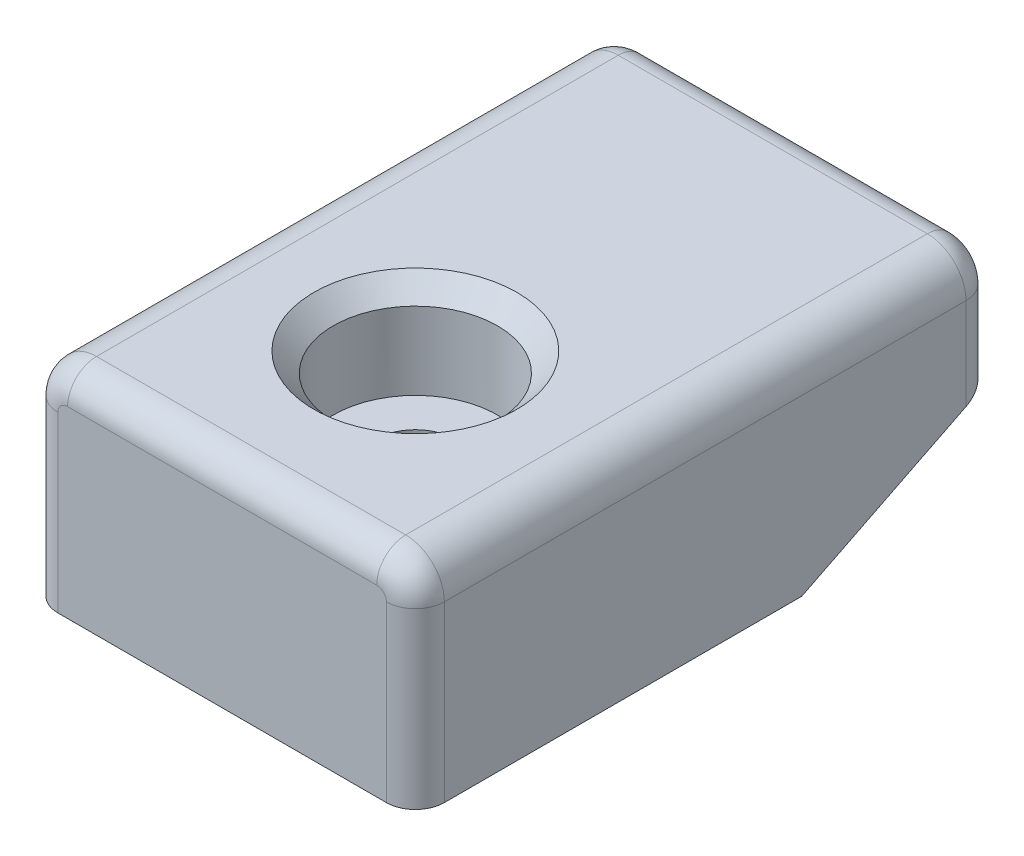
ISO-10303-21;
HEADER;
FILE_DESCRIPTION(('STEP AP214'),'2;1');
FILE_NAME('part.step','',(''),(''),'','','');
FILE_SCHEMA(('AUTOMOTIVE_DESIGN { 1 0 10303 214 1 1 1 1 }'));
ENDSEC;
DATA;
#1=APPLICATION_CONTEXT('core data for automotive mechanical design processes');
#2=APPLICATION_PROTOCOL_DEFINITION('international standard','automotive_design',2000,#1);
#3=PRODUCT_CONTEXT('',#1,'mechanical');
#4=PRODUCT('Part','Part','',(#3));
#5=PRODUCT_RELATED_PRODUCT_CATEGORY('part','',(#4));
#6=PRODUCT_DEFINITION_FORMATION('','',#4);
#7=PRODUCT_DEFINITION_CONTEXT('part definition',#1,'design');
#8=PRODUCT_DEFINITION('design','',#6,#7);
#9=PRODUCT_DEFINITION_SHAPE('','',#8);
#10=(LENGTH_UNIT() NAMED_UNIT(*) SI_UNIT(.MILLI.,.METRE.));
#11=(NAMED_UNIT(*) PLANE_ANGLE_UNIT() SI_UNIT($,.RADIAN.));
#12=(NAMED_UNIT(*) SI_UNIT($,.STERADIAN.) SOLID_ANGLE_UNIT());
#13=UNCERTAINTY_MEASURE_WITH_UNIT(LENGTH_MEASURE(1.E-05),#10,'distance_accuracy_value','');
#14=(GEOMETRIC_REPRESENTATION_CONTEXT(3) GLOBAL_UNCERTAINTY_ASSIGNED_CONTEXT((#13)) GLOBAL_UNIT_ASSIGNED_CONTEXT((#10,
#11,#12)) REPRESENTATION_CONTEXT('',''));
#15=CARTESIAN_POINT('',(0.,0.,0.));
#16=DIRECTION('',(0.,0.,1.));
#17=DIRECTION('',(1.,0.,0.));
#18=AXIS2_PLACEMENT_3D('',#15,#16,#17);
#19=CARTESIAN_POINT('',(0.,11.,9.91087244163016));
#20=DIRECTION('',(0.,-1.,0.));
#21=DIRECTION('',(0.,0.,-1.));
#22=AXIS2_PLACEMENT_3D('',#19,#20,#21);
#23=CYLINDRICAL_SURFACE('',#22,4.15);
#24=CARTESIAN_POINT('',(0.,-11.,9.91087244163016));
#25=DIRECTION('',(0.,1.,0.));
#26=DIRECTION('',(0.,0.,1.));
#27=AXIS2_PLACEMENT_3D('',#24,#25,#26);
#28=CIRCLE('',#27,4.15);
#29=CARTESIAN_POINT('',(0.,-11.,14.0608724416302));
#30=VERTEX_POINT('',#29);
#31=EDGE_CURVE('E262',#30,#30,#28,.T.);
#32=ORIENTED_EDGE('',*,*,#31,.F.);
#33=EDGE_LOOP('',(#32));
#34=FACE_BOUND('',#33,.T.);
#35=CARTESIAN_POINT('',(0.,0.999999999999999,9.91087244163016));
#36=DIRECTION('',(0.,1.,0.));
#37=DIRECTION('',(0.,0.,1.));
#38=AXIS2_PLACEMENT_3D('',#35,#36,#37);
#39=CIRCLE('',#38,4.15);
#40=CARTESIAN_POINT('',(0.,0.999999999999999,14.0608724416302));
#41=VERTEX_POINT('',#40);
#42=EDGE_CURVE('E260',#41,#41,#39,.T.);
#43=ORIENTED_EDGE('',*,*,#42,.T.);
#44=EDGE_LOOP('',(#43));
#45=FACE_BOUND('',#44,.T.);
#46=ADVANCED_FACE('F49',(#34,#45),#23,.F.);
#47=CARTESIAN_POINT('',(0.,11.,0.));
#48=DIRECTION('',(0.,-1.,0.));
#49=DIRECTION('',(0.,0.,-1.));
#50=AXIS2_PLACEMENT_3D('',#47,#48,#49);
#51=PLANE('',#50);
#52=CARTESIAN_POINT('',(0.,11.,9.91087244163016));
#53=DIRECTION('',(0.,-1.,0.));
#54=DIRECTION('',(0.,0.,-1.));
#55=AXIS2_PLACEMENT_3D('',#52,#53,#54);
#56=CIRCLE('',#55,10.5);
#57=CARTESIAN_POINT('',(0.,11.,-0.589127558369852));
#58=VERTEX_POINT('',#57);
#59=EDGE_CURVE('E274',#58,#58,#56,.T.);
#60=ORIENTED_EDGE('',*,*,#59,.T.);
#61=EDGE_LOOP('',(#60));
#62=FACE_BOUND('',#61,.T.);
#63=DIRECTION('',(0.,0.,1.));
#64=VECTOR('',#63,1.);
#65=CARTESIAN_POINT('',(-16.0000000000001,11.,0.));
#66=LINE('',#65,#64);
#67=CARTESIAN_POINT('',(-16.0000000000001,11.,-27.0891275583698));
#68=VERTEX_POINT('',#67);
#69=CARTESIAN_POINT('',(-16.0000000000001,11.,26.9108724416302));
#70=VERTEX_POINT('',#69);
#71=EDGE_CURVE('E256',#68,#70,#66,.T.);
#72=ORIENTED_EDGE('',*,*,#71,.T.);
#73=DIRECTION('',(1.,0.,0.));
#74=VECTOR('',#73,1.);
#75=CARTESIAN_POINT('',(0.,11.,26.9108724416302));
#76=LINE('',#75,#74);
#77=CARTESIAN_POINT('',(15.9999999999999,11.,26.9108724416302));
#78=VERTEX_POINT('',#77);
#79=EDGE_CURVE('E11',#70,#78,#76,.T.);
#80=ORIENTED_EDGE('',*,*,#79,.T.);
#81=DIRECTION('',(0.,0.,-1.));
#82=VECTOR('',#81,1.);
#83=CARTESIAN_POINT('',(15.9999999999999,11.,0.));
#84=LINE('',#83,#82);
#85=CARTESIAN_POINT('',(15.9999999999999,11.,-27.0891275583698));
#86=VERTEX_POINT('',#85);
#87=EDGE_CURVE('E253',#78,#86,#84,.T.);
#88=ORIENTED_EDGE('',*,*,#87,.T.);
#89=DIRECTION('',(-1.,0.,0.));
#90=VECTOR('',#89,1.);
#91=CARTESIAN_POINT('',(0.,11.,-27.0891275583698));
#92=LINE('',#91,#90);
#93=EDGE_CURVE('E58',#86,#68,#92,.T.);
#94=ORIENTED_EDGE('',*,*,#93,.T.);
#95=EDGE_LOOP('',(#72,#80,#88,#94));
#96=FACE_BOUND('',#95,.T.);
#97=ADVANCED_FACE('F329',(#62,#96),#51,.F.);
#98=CARTESIAN_POINT('',(0.,-11.,0.));
#99=DIRECTION('',(0.,-1.,0.));
#100=DIRECTION('',(0.,0.,-1.));
#101=AXIS2_PLACEMENT_3D('',#98,#99,#100);
#102=PLANE('',#101);
#103=DIRECTION('',(0.,0.,-1.));
#104=VECTOR('',#103,1.);
#105=CARTESIAN_POINT('',(19.9999999999999,-11.,29.9108724416302));
#106=LINE('',#105,#104);
#107=CARTESIAN_POINT('',(19.9999999999999,-11.,26.9108724416302));
#108=VERTEX_POINT('',#107);
#109=CARTESIAN_POINT('',(19.9999999999999,-11.,-10.0891275583697));
#110=VERTEX_POINT('',#109);
#111=EDGE_CURVE('E168',#108,#110,#106,.T.);
#112=ORIENTED_EDGE('',*,*,#111,.F.);
#113=CARTESIAN_POINT('',(17.,-11.,26.9108724416302));
#114=DIRECTION('',(0.,-1.,0.));
#115=DIRECTION('',(0.,0.,-1.));
#116=AXIS2_PLACEMENT_3D('',#113,#114,#115);
#117=CIRCLE('',#116,3.);
#118=CARTESIAN_POINT('',(17.,-11.,29.9108724416302));
#119=VERTEX_POINT('',#118);
#120=EDGE_CURVE('E210',#108,#119,#117,.T.);
#121=ORIENTED_EDGE('',*,*,#120,.T.);
#122=DIRECTION('',(1.,0.,0.));
#123=VECTOR('',#122,1.);
#124=CARTESIAN_POINT('',(-20.0000000000001,-11.,29.9108724416302));
#125=LINE('',#124,#123);
#126=CARTESIAN_POINT('',(-17.0000000000001,-11.,29.9108724416302));
#127=VERTEX_POINT('',#126);
#128=EDGE_CURVE('E167',#127,#119,#125,.T.);
#129=ORIENTED_EDGE('',*,*,#128,.F.);
#130=CARTESIAN_POINT('',(-17.0000000000001,-11.,26.9108724416302));
#131=DIRECTION('',(0.,-1.,0.));
#132=DIRECTION('',(0.,0.,-1.));
#133=AXIS2_PLACEMENT_3D('',#130,#131,#132);
#134=CIRCLE('',#133,3.);
#135=CARTESIAN_POINT('',(-20.0000000000001,-11.,26.9108724416302));
#136=VERTEX_POINT('',#135);
#137=EDGE_CURVE('E166',#127,#136,#134,.T.);
#138=ORIENTED_EDGE('',*,*,#137,.T.);
#139=DIRECTION('',(0.,0.,1.));
#140=VECTOR('',#139,1.);
#141=CARTESIAN_POINT('',(-20.0000000000001,-11.,29.9108724416302));
#142=LINE('',#141,#140);
#143=CARTESIAN_POINT('',(-20.0000000000001,-11.,-10.0891275583697));
#144=VERTEX_POINT('',#143);
#145=EDGE_CURVE('E148',#144,#136,#142,.T.);
#146=ORIENTED_EDGE('',*,*,#145,.F.);
#147=DIRECTION('',(1.,0.,0.));
#148=VECTOR('',#147,1.);
#149=CARTESIAN_POINT('',(19.9999999999999,-11.,-10.0891275583697));
#150=LINE('',#149,#148);
#151=EDGE_CURVE('E155',#144,#110,#150,.T.);
#152=ORIENTED_EDGE('',*,*,#151,.T.);
#153=EDGE_LOOP('',(#112,#121,#129,#138,#146,#152));
#154=FACE_BOUND('',#153,.T.);
#155=ORIENTED_EDGE('',*,*,#31,.T.);
#156=EDGE_LOOP('',(#155));
#157=FACE_BOUND('',#156,.T.);
#158=ADVANCED_FACE('F161',(#154,#157),#102,.T.);
#159=CARTESIAN_POINT('',(19.9999999999999,11.,29.9108724416302));
#160=DIRECTION('',(-1.,0.,0.));
#161=DIRECTION('',(0.,0.,1.));
#162=AXIS2_PLACEMENT_3D('',#159,#160,#161);
#163=PLANE('',#162);
#164=DIRECTION('',(0.,0.447213595499956,-0.894427190999917));
#165=VECTOR('',#164,1.);
#166=CARTESIAN_POINT('',(19.9999999999999,-0.999999999999997,-30.0891275583698));
#167=LINE('',#166,#165);
#168=CARTESIAN_POINT('',(19.9999999999999,-2.49999999999999,-27.0891275583698));
#169=VERTEX_POINT('',#168);
#170=EDGE_CURVE('E173',#110,#169,#167,.T.);
#171=ORIENTED_EDGE('',*,*,#170,.T.);
#172=DIRECTION('',(0.,-1.,0.));
#173=VECTOR('',#172,1.);
#174=CARTESIAN_POINT('',(19.9999999999999,11.,-27.0891275583698));
#175=LINE('',#174,#173);
#176=CARTESIAN_POINT('',(19.9999999999999,7.,-27.0891275583698));
#177=VERTEX_POINT('',#176);
#178=EDGE_CURVE('E196',#169,#177,#175,.F.);
#179=ORIENTED_EDGE('',*,*,#178,.T.);
#180=DIRECTION('',(0.,0.,-1.));
#181=VECTOR('',#180,1.);
#182=CARTESIAN_POINT('',(19.9999999999999,7.,29.9108724416302));
#183=LINE('',#182,#181);
#184=CARTESIAN_POINT('',(19.9999999999999,7.,26.9108724416302));
#185=VERTEX_POINT('',#184);
#186=EDGE_CURVE('E268',#177,#185,#183,.F.);
#187=ORIENTED_EDGE('',*,*,#186,.T.);
#188=DIRECTION('',(0.,-1.,0.));
#189=VECTOR('',#188,1.);
#190=CARTESIAN_POINT('',(19.9999999999999,11.,26.9108724416302));
#191=LINE('',#190,#189);
#192=EDGE_CURVE('E193',#185,#108,#191,.T.);
#193=ORIENTED_EDGE('',*,*,#192,.T.);
#194=ORIENTED_EDGE('',*,*,#111,.T.);
#195=EDGE_LOOP('',(#171,#179,#187,#193,#194));
#196=FACE_BOUND('',#195,.T.);
#197=ADVANCED_FACE('F303',(#196),#163,.F.);
#198=CARTESIAN_POINT('',(-20.0000000000001,11.,-30.0891275583698));
#199=DIRECTION('',(0.,0.,1.));
#200=DIRECTION('',(1.,0.,0.));
#201=AXIS2_PLACEMENT_3D('',#198,#199,#200);
#202=PLANE('',#201);
#203=CARTESIAN_POINT('',(15.9999999999999,7.,-30.0891275583698));
#204=DIRECTION('',(0.,0.,1.));
#205=DIRECTION('',(1.,0.,0.));
#206=AXIS2_PLACEMENT_3D('',#203,#204,#205);
#207=CIRCLE('',#206,1.);
#208=CARTESIAN_POINT('',(15.9999999999999,8.,-30.0891275583698));
#209=VERTEX_POINT('',#208);
#210=CARTESIAN_POINT('',(17.,7.,-30.0891275583698));
#211=VERTEX_POINT('',#210);
#212=EDGE_CURVE('E184',#209,#211,#207,.F.);
#213=ORIENTED_EDGE('',*,*,#212,.T.);
#214=DIRECTION('',(0.,-1.,0.));
#215=VECTOR('',#214,1.);
#216=CARTESIAN_POINT('',(17.,11.,-30.0891275583698));
#217=LINE('',#216,#215);
#218=CARTESIAN_POINT('',(17.,-0.999999999999997,-30.0891275583698));
#219=VERTEX_POINT('',#218);
#220=EDGE_CURVE('E186',#211,#219,#217,.T.);
#221=ORIENTED_EDGE('',*,*,#220,.T.);
#222=DIRECTION('',(-1.,0.,0.));
#223=VECTOR('',#222,1.);
#224=CARTESIAN_POINT('',(-20.0000000000001,-0.999999999999997,-30.0891275583698));
#225=LINE('',#224,#223);
#226=CARTESIAN_POINT('',(-17.0000000000001,-0.999999999999997,-30.0891275583698));
#227=VERTEX_POINT('',#226);
#228=EDGE_CURVE('E156',#219,#227,#225,.T.);
#229=ORIENTED_EDGE('',*,*,#228,.T.);
#230=DIRECTION('',(0.,-1.,0.));
#231=VECTOR('',#230,1.);
#232=CARTESIAN_POINT('',(-17.0000000000001,11.,-30.0891275583698));
#233=LINE('',#232,#231);
#234=CARTESIAN_POINT('',(-17.0000000000001,7.,-30.0891275583698));
#235=VERTEX_POINT('',#234);
#236=EDGE_CURVE('E182',#227,#235,#233,.F.);
#237=ORIENTED_EDGE('',*,*,#236,.T.);
#238=CARTESIAN_POINT('',(-16.0000000000001,7.,-30.0891275583698));
#239=DIRECTION('',(0.,0.,1.));
#240=DIRECTION('',(1.,0.,0.));
#241=AXIS2_PLACEMENT_3D('',#238,#239,#240);
#242=CIRCLE('',#241,1.);
#243=CARTESIAN_POINT('',(-16.0000000000001,8.,-30.0891275583698));
#244=VERTEX_POINT('',#243);
#245=EDGE_CURVE('E180',#235,#244,#242,.F.);
#246=ORIENTED_EDGE('',*,*,#245,.T.);
#247=DIRECTION('',(-1.,0.,0.));
#248=VECTOR('',#247,1.);
#249=CARTESIAN_POINT('',(-20.0000000000001,8.,-30.0891275583698));
#250=LINE('',#249,#248);
#251=EDGE_CURVE('E175',#244,#209,#250,.F.);
#252=ORIENTED_EDGE('',*,*,#251,.T.);
#253=EDGE_LOOP('',(#213,#221,#229,#237,#246,#252));
#254=FACE_BOUND('',#253,.T.);
#255=ADVANCED_FACE('F279',(#254),#202,.F.);
#256=CARTESIAN_POINT('',(-20.0000000000001,11.,29.9108724416302));
#257=DIRECTION('',(1.,0.,0.));
#258=DIRECTION('',(0.,0.,-1.));
#259=AXIS2_PLACEMENT_3D('',#256,#257,#258);
#260=PLANE('',#259);
#261=DIRECTION('',(0.,0.,1.));
#262=VECTOR('',#261,1.);
#263=CARTESIAN_POINT('',(-20.0000000000001,7.,29.9108724416302));
#264=LINE('',#263,#262);
#265=CARTESIAN_POINT('',(-20.0000000000001,7.,26.9108724416302));
#266=VERTEX_POINT('',#265);
#267=CARTESIAN_POINT('',(-20.0000000000001,7.,-27.0891275583698));
#268=VERTEX_POINT('',#267);
#269=EDGE_CURVE('E266',#266,#268,#264,.F.);
#270=ORIENTED_EDGE('',*,*,#269,.T.);
#271=DIRECTION('',(0.,-1.,0.));
#272=VECTOR('',#271,1.);
#273=CARTESIAN_POINT('',(-20.0000000000001,11.,-27.0891275583698));
#274=LINE('',#273,#272);
#275=CARTESIAN_POINT('',(-20.0000000000001,-2.49999999999999,-27.0891275583698));
#276=VERTEX_POINT('',#275);
#277=EDGE_CURVE('E151',#268,#276,#274,.T.);
#278=ORIENTED_EDGE('',*,*,#277,.T.);
#279=DIRECTION('',(0.,-0.447213595499956,0.894427190999917));
#280=VECTOR('',#279,1.);
#281=CARTESIAN_POINT('',(-20.0000000000001,-0.999999999999997,-30.0891275583698));
#282=LINE('',#281,#280);
#283=EDGE_CURVE('E144',#276,#144,#282,.T.);
#284=ORIENTED_EDGE('',*,*,#283,.T.);
#285=ORIENTED_EDGE('',*,*,#145,.T.);
#286=DIRECTION('',(0.,-1.,0.));
#287=VECTOR('',#286,1.);
#288=CARTESIAN_POINT('',(-20.0000000000001,11.,26.9108724416302));
#289=LINE('',#288,#287);
#290=EDGE_CURVE('E202',#136,#266,#289,.F.);
#291=ORIENTED_EDGE('',*,*,#290,.T.);
#292=EDGE_LOOP('',(#270,#278,#284,#285,#291));
#293=FACE_BOUND('',#292,.T.);
#294=ADVANCED_FACE('F147',(#293),#260,.F.);
#295=CARTESIAN_POINT('',(-20.0000000000001,11.,29.9108724416302));
#296=DIRECTION('',(0.,0.,-1.));
#297=DIRECTION('',(-1.,0.,0.));
#298=AXIS2_PLACEMENT_3D('',#295,#296,#297);
#299=PLANE('',#298);
#300=ORIENTED_EDGE('',*,*,#128,.T.);
#301=DIRECTION('',(0.,-1.,0.));
#302=VECTOR('',#301,1.);
#303=CARTESIAN_POINT('',(17.,11.,29.9108724416302));
#304=LINE('',#303,#302);
#305=CARTESIAN_POINT('',(17.,7.,29.9108724416302));
#306=VERTEX_POINT('',#305);
#307=EDGE_CURVE('E66',#119,#306,#304,.F.);
#308=ORIENTED_EDGE('',*,*,#307,.T.);
#309=CARTESIAN_POINT('',(15.9999999999999,7.,29.9108724416302));
#310=DIRECTION('',(0.,0.,-1.));
#311=DIRECTION('',(-1.,0.,0.));
#312=AXIS2_PLACEMENT_3D('',#309,#310,#311);
#313=CIRCLE('',#312,1.);
#314=CARTESIAN_POINT('',(15.9999999999999,8.,29.9108724416302));
#315=VERTEX_POINT('',#314);
#316=EDGE_CURVE('E70',#306,#315,#313,.F.);
#317=ORIENTED_EDGE('',*,*,#316,.T.);
#318=DIRECTION('',(1.,0.,0.));
#319=VECTOR('',#318,1.);
#320=CARTESIAN_POINT('',(-20.0000000000001,8.,29.9108724416302));
#321=LINE('',#320,#319);
#322=CARTESIAN_POINT('',(-16.0000000000001,8.,29.9108724416302));
#323=VERTEX_POINT('',#322);
#324=EDGE_CURVE('E216',#315,#323,#321,.F.);
#325=ORIENTED_EDGE('',*,*,#324,.T.);
#326=CARTESIAN_POINT('',(-16.0000000000001,7.,29.9108724416302));
#327=DIRECTION('',(0.,0.,-1.));
#328=DIRECTION('',(-1.,0.,0.));
#329=AXIS2_PLACEMENT_3D('',#326,#327,#328);
#330=CIRCLE('',#329,1.);
#331=CARTESIAN_POINT('',(-17.0000000000001,7.,29.9108724416302));
#332=VERTEX_POINT('',#331);
#333=EDGE_CURVE('E214',#323,#332,#330,.F.);
#334=ORIENTED_EDGE('',*,*,#333,.T.);
#335=DIRECTION('',(0.,-1.,0.));
#336=VECTOR('',#335,1.);
#337=CARTESIAN_POINT('',(-17.0000000000001,11.,29.9108724416302));
#338=LINE('',#337,#336);
#339=EDGE_CURVE('E212',#332,#127,#338,.T.);
#340=ORIENTED_EDGE('',*,*,#339,.T.);
#341=EDGE_LOOP('',(#300,#308,#317,#325,#334,#340));
#342=FACE_BOUND('',#341,.T.);
#343=ADVANCED_FACE('F252',(#342),#299,.F.);
#344=CARTESIAN_POINT('',(0.,0.999999999999999,9.91087244163016));
#345=DIRECTION('',(0.,1.,0.));
#346=DIRECTION('',(0.,0.,1.));
#347=AXIS2_PLACEMENT_3D('',#344,#345,#346);
#348=CYLINDRICAL_SURFACE('',#347,8.5);
#349=CARTESIAN_POINT('',(0.,8.99999999999999,9.91087244163016));
#350=DIRECTION('',(0.,-1.,0.));
#351=DIRECTION('',(0.,0.,-1.));
#352=AXIS2_PLACEMENT_3D('',#349,#350,#351);
#353=CIRCLE('',#352,8.5);
#354=CARTESIAN_POINT('',(0.,8.99999999999999,1.41087244163016));
#355=VERTEX_POINT('',#354);
#356=EDGE_CURVE('E271',#355,#355,#353,.F.);
#357=ORIENTED_EDGE('',*,*,#356,.T.);
#358=EDGE_LOOP('',(#357));
#359=FACE_BOUND('',#358,.T.);
#360=CARTESIAN_POINT('',(0.,0.999999999999999,9.91087244163016));
#361=DIRECTION('',(0.,1.,0.));
#362=DIRECTION('',(0.,0.,1.));
#363=AXIS2_PLACEMENT_3D('',#360,#361,#362);
#364=CIRCLE('',#363,8.5);
#365=CARTESIAN_POINT('',(0.,0.999999999999999,18.4108724416302));
#366=VERTEX_POINT('',#365);
#367=EDGE_CURVE('E233',#366,#366,#364,.T.);
#368=ORIENTED_EDGE('',*,*,#367,.F.);
#369=EDGE_LOOP('',(#368));
#370=FACE_BOUND('',#369,.T.);
#371=ADVANCED_FACE('F314',(#359,#370),#348,.F.);
#372=CARTESIAN_POINT('',(0.,0.999999999999999,9.91087244163016));
#373=DIRECTION('',(0.,1.,0.));
#374=DIRECTION('',(0.,0.,1.));
#375=AXIS2_PLACEMENT_3D('',#372,#373,#374);
#376=PLANE('',#375);
#377=ORIENTED_EDGE('',*,*,#42,.F.);
#378=EDGE_LOOP('',(#377));
#379=FACE_BOUND('',#378,.T.);
#380=ORIENTED_EDGE('',*,*,#367,.T.);
#381=EDGE_LOOP('',(#380));
#382=FACE_BOUND('',#381,.T.);
#383=ADVANCED_FACE('F312',(#379,#382),#376,.T.);
#384=CARTESIAN_POINT('',(-16.0000000000001,7.,0.));
#385=DIRECTION('',(0.,0.,1.));
#386=DIRECTION('',(1.,0.,0.));
#387=AXIS2_PLACEMENT_3D('',#384,#385,#386);
#388=CYLINDRICAL_SURFACE('',#387,4.);
#389=ORIENTED_EDGE('',*,*,#71,.F.);
#390=CARTESIAN_POINT('',(-16.0000000000001,7.,-27.0891275583698));
#391=DIRECTION('',(0.,0.,1.));
#392=DIRECTION('',(1.,0.,0.));
#393=AXIS2_PLACEMENT_3D('',#390,#391,#392);
#394=CIRCLE('',#393,4.);
#395=EDGE_CURVE('E207',#68,#268,#394,.T.);
#396=ORIENTED_EDGE('',*,*,#395,.T.);
#397=ORIENTED_EDGE('',*,*,#269,.F.);
#398=CARTESIAN_POINT('',(-16.0000000000001,7.,26.9108724416302));
#399=DIRECTION('',(0.,0.,-1.));
#400=DIRECTION('',(-1.,0.,0.));
#401=AXIS2_PLACEMENT_3D('',#398,#399,#400);
#402=CIRCLE('',#401,4.);
#403=EDGE_CURVE('E205',#266,#70,#402,.T.);
#404=ORIENTED_EDGE('',*,*,#403,.T.);
#405=EDGE_LOOP('',(#389,#396,#397,#404));
#406=FACE_BOUND('',#405,.T.);
#407=ADVANCED_FACE('F322',(#406),#388,.T.);
#408=CARTESIAN_POINT('',(15.9999999999999,7.,0.));
#409=DIRECTION('',(0.,0.,-1.));
#410=DIRECTION('',(-1.,0.,0.));
#411=AXIS2_PLACEMENT_3D('',#408,#409,#410);
#412=CYLINDRICAL_SURFACE('',#411,4.);
#413=ORIENTED_EDGE('',*,*,#186,.F.);
#414=CARTESIAN_POINT('',(15.9999999999999,7.,-27.0891275583698));
#415=DIRECTION('',(0.,0.,1.));
#416=DIRECTION('',(1.,0.,0.));
#417=AXIS2_PLACEMENT_3D('',#414,#415,#416);
#418=CIRCLE('',#417,4.);
#419=EDGE_CURVE('E200',#177,#86,#418,.T.);
#420=ORIENTED_EDGE('',*,*,#419,.T.);
#421=ORIENTED_EDGE('',*,*,#87,.F.);
#422=CARTESIAN_POINT('',(15.9999999999999,7.,26.9108724416302));
#423=DIRECTION('',(0.,0.,-1.));
#424=DIRECTION('',(-1.,0.,0.));
#425=AXIS2_PLACEMENT_3D('',#422,#423,#424);
#426=CIRCLE('',#425,4.);
#427=EDGE_CURVE('E198',#78,#185,#426,.T.);
#428=ORIENTED_EDGE('',*,*,#427,.T.);
#429=EDGE_LOOP('',(#413,#420,#421,#428));
#430=FACE_BOUND('',#429,.T.);
#431=ADVANCED_FACE('F349',(#430),#412,.T.);
#432=CARTESIAN_POINT('',(0.,8.99999999999999,9.91087244163016));
#433=DIRECTION('',(0.,1.,0.));
#434=DIRECTION('',(0.,0.,1.));
#435=AXIS2_PLACEMENT_3D('',#432,#433,#434);
#436=CONICAL_SURFACE('',#435,8.5,0.78539816339745);
#437=ORIENTED_EDGE('',*,*,#59,.F.);
#438=EDGE_LOOP('',(#437));
#439=FACE_BOUND('',#438,.T.);
#440=ORIENTED_EDGE('',*,*,#356,.F.);
#441=EDGE_LOOP('',(#440));
#442=FACE_BOUND('',#441,.T.);
#443=ADVANCED_FACE('F353',(#439,#442),#436,.F.);
#444=CARTESIAN_POINT('',(-20.0000000000001,-0.999999999999997,-30.0891275583698));
#445=DIRECTION('',(0.,-0.894427190999917,-0.447213595499956));
#446=DIRECTION('',(1.,0.,0.));
#447=AXIS2_PLACEMENT_3D('',#444,#445,#446);
#448=PLANE('',#447);
#449=ORIENTED_EDGE('',*,*,#228,.F.);
#450=CARTESIAN_POINT('',(17.,-2.49999999999999,-27.0891275583698));
#451=DIRECTION('',(0.,-0.894427190999917,-0.447213595499956));
#452=DIRECTION('',(0.,-0.447213595499956,0.894427190999917));
#453=AXIS2_PLACEMENT_3D('',#450,#451,#452);
#454=ELLIPSE('',#453,3.35410196624968,3.);
#455=EDGE_CURVE('E191',#219,#169,#454,.T.);
#456=ORIENTED_EDGE('',*,*,#455,.T.);
#457=ORIENTED_EDGE('',*,*,#170,.F.);
#458=ORIENTED_EDGE('',*,*,#151,.F.);
#459=ORIENTED_EDGE('',*,*,#283,.F.);
#460=CARTESIAN_POINT('',(-17.0000000000001,-2.49999999999999,-27.0891275583698));
#461=DIRECTION('',(0.,-0.894427190999917,-0.447213595499956));
#462=DIRECTION('',(0.,-0.447213595499956,0.894427190999917));
#463=AXIS2_PLACEMENT_3D('',#460,#461,#462);
#464=ELLIPSE('',#463,3.35410196624968,3.);
#465=EDGE_CURVE('E189',#276,#227,#464,.T.);
#466=ORIENTED_EDGE('',*,*,#465,.T.);
#467=EDGE_LOOP('',(#449,#456,#457,#458,#459,#466));
#468=FACE_BOUND('',#467,.T.);
#469=ADVANCED_FACE('F171',(#468),#448,.T.);
#470=CARTESIAN_POINT('',(-17.0000000000001,11.,-27.0891275583698));
#471=DIRECTION('',(0.,-1.,0.));
#472=DIRECTION('',(0.,0.,-1.));
#473=AXIS2_PLACEMENT_3D('',#470,#471,#472);
#474=CYLINDRICAL_SURFACE('',#473,3.);
#475=ORIENTED_EDGE('',*,*,#465,.F.);
#476=ORIENTED_EDGE('',*,*,#277,.F.);
#477=CARTESIAN_POINT('',(-17.0000000000001,7.,-27.0891275583698));
#478=DIRECTION('',(0.,1.,0.));
#479=DIRECTION('',(0.,0.,1.));
#480=AXIS2_PLACEMENT_3D('',#477,#478,#479);
#481=CIRCLE('',#480,3.);
#482=EDGE_CURVE('E230',#235,#268,#481,.T.);
#483=ORIENTED_EDGE('',*,*,#482,.F.);
#484=ORIENTED_EDGE('',*,*,#236,.F.);
#485=EDGE_LOOP('',(#475,#476,#483,#484));
#486=FACE_BOUND('',#485,.T.);
#487=ADVANCED_FACE('F283',(#486),#474,.T.);
#488=CARTESIAN_POINT('',(-16.0000000000001,7.,-27.0891275583698));
#489=DIRECTION('',(0.,0.,1.));
#490=DIRECTION('',(1.,0.,0.));
#491=AXIS2_PLACEMENT_3D('',#488,#489,#490);
#492=DEGENERATE_TOROIDAL_SURFACE('',#491,1.,3.,.T.);
#493=ORIENTED_EDGE('',*,*,#482,.T.);
#494=ORIENTED_EDGE('',*,*,#395,.F.);
#495=CARTESIAN_POINT('',(-16.0000000000001,8.,-27.0891275583698));
#496=DIRECTION('',(1.,0.,0.));
#497=DIRECTION('',(0.,0.,-1.));
#498=AXIS2_PLACEMENT_3D('',#495,#496,#497);
#499=CIRCLE('',#498,3.);
#500=EDGE_CURVE('E227',#244,#68,#499,.T.);
#501=ORIENTED_EDGE('',*,*,#500,.F.);
#502=ORIENTED_EDGE('',*,*,#245,.F.);
#503=EDGE_LOOP('',(#493,#494,#501,#502));
#504=FACE_BOUND('',#503,.T.);
#505=ADVANCED_FACE('F288',(#504),#492,.T.);
#506=CARTESIAN_POINT('',(0.,8.,-27.0891275583698));
#507=DIRECTION('',(-1.,0.,0.));
#508=DIRECTION('',(0.,0.,1.));
#509=AXIS2_PLACEMENT_3D('',#506,#507,#508);
#510=CYLINDRICAL_SURFACE('',#509,3.);
#511=ORIENTED_EDGE('',*,*,#500,.T.);
#512=ORIENTED_EDGE('',*,*,#93,.F.);
#513=CARTESIAN_POINT('',(15.9999999999999,8.,-27.0891275583698));
#514=DIRECTION('',(1.,0.,0.));
#515=DIRECTION('',(0.,0.,-1.));
#516=AXIS2_PLACEMENT_3D('',#513,#514,#515);
#517=CIRCLE('',#516,3.);
#518=EDGE_CURVE('E224',#209,#86,#517,.T.);
#519=ORIENTED_EDGE('',*,*,#518,.F.);
#520=ORIENTED_EDGE('',*,*,#251,.F.);
#521=EDGE_LOOP('',(#511,#512,#519,#520));
#522=FACE_BOUND('',#521,.T.);
#523=ADVANCED_FACE('F295',(#522),#510,.T.);
#524=CARTESIAN_POINT('',(15.9999999999999,7.,-27.0891275583698));
#525=DIRECTION('',(0.,0.,1.));
#526=DIRECTION('',(1.,0.,0.));
#527=AXIS2_PLACEMENT_3D('',#524,#525,#526);
#528=DEGENERATE_TOROIDAL_SURFACE('',#527,1.,3.,.T.);
#529=ORIENTED_EDGE('',*,*,#518,.T.);
#530=ORIENTED_EDGE('',*,*,#419,.F.);
#531=CARTESIAN_POINT('',(17.,7.,-27.0891275583698));
#532=DIRECTION('',(0.,-1.,0.));
#533=DIRECTION('',(0.,0.,-1.));
#534=AXIS2_PLACEMENT_3D('',#531,#532,#533);
#535=CIRCLE('',#534,3.);
#536=EDGE_CURVE('E221',#211,#177,#535,.T.);
#537=ORIENTED_EDGE('',*,*,#536,.F.);
#538=ORIENTED_EDGE('',*,*,#212,.F.);
#539=EDGE_LOOP('',(#529,#530,#537,#538));
#540=FACE_BOUND('',#539,.T.);
#541=ADVANCED_FACE('F298',(#540),#528,.T.);
#542=CARTESIAN_POINT('',(17.,11.,-27.0891275583698));
#543=DIRECTION('',(0.,-1.,0.));
#544=DIRECTION('',(0.,0.,-1.));
#545=AXIS2_PLACEMENT_3D('',#542,#543,#544);
#546=CYLINDRICAL_SURFACE('',#545,3.);
#547=ORIENTED_EDGE('',*,*,#536,.T.);
#548=ORIENTED_EDGE('',*,*,#178,.F.);
#549=ORIENTED_EDGE('',*,*,#455,.F.);
#550=ORIENTED_EDGE('',*,*,#220,.F.);
#551=EDGE_LOOP('',(#547,#548,#549,#550));
#552=FACE_BOUND('',#551,.T.);
#553=ADVANCED_FACE('F301',(#552),#546,.T.);
#554=CARTESIAN_POINT('',(-17.0000000000001,11.,26.9108724416302));
#555=DIRECTION('',(0.,-1.,0.));
#556=DIRECTION('',(0.,0.,-1.));
#557=AXIS2_PLACEMENT_3D('',#554,#555,#556);
#558=CYLINDRICAL_SURFACE('',#557,3.);
#559=ORIENTED_EDGE('',*,*,#137,.F.);
#560=ORIENTED_EDGE('',*,*,#339,.F.);
#561=CARTESIAN_POINT('',(-17.0000000000001,7.,26.9108724416302));
#562=DIRECTION('',(0.,1.,0.));
#563=DIRECTION('',(0.,0.,1.));
#564=AXIS2_PLACEMENT_3D('',#561,#562,#563);
#565=CIRCLE('',#564,3.);
#566=EDGE_CURVE('E53',#266,#332,#565,.T.);
#567=ORIENTED_EDGE('',*,*,#566,.F.);
#568=ORIENTED_EDGE('',*,*,#290,.F.);
#569=EDGE_LOOP('',(#559,#560,#567,#568));
#570=FACE_BOUND('',#569,.T.);
#571=ADVANCED_FACE('F51',(#570),#558,.T.);
#572=CARTESIAN_POINT('',(-16.0000000000001,7.,26.9108724416302));
#573=DIRECTION('',(0.,0.,-1.));
#574=DIRECTION('',(-1.,0.,0.));
#575=AXIS2_PLACEMENT_3D('',#572,#573,#574);
#576=DEGENERATE_TOROIDAL_SURFACE('',#575,1.,3.,.T.);
#577=ORIENTED_EDGE('',*,*,#566,.T.);
#578=ORIENTED_EDGE('',*,*,#333,.F.);
#579=CARTESIAN_POINT('',(-16.0000000000001,8.,26.9108724416302));
#580=DIRECTION('',(1.,0.,0.));
#581=DIRECTION('',(0.,0.,-1.));
#582=AXIS2_PLACEMENT_3D('',#579,#580,#581);
#583=CIRCLE('',#582,3.);
#584=EDGE_CURVE('E239',#70,#323,#583,.T.);
#585=ORIENTED_EDGE('',*,*,#584,.F.);
#586=ORIENTED_EDGE('',*,*,#403,.F.);
#587=EDGE_LOOP('',(#577,#578,#585,#586));
#588=FACE_BOUND('',#587,.T.);
#589=ADVANCED_FACE('F249',(#588),#576,.T.);
#590=CARTESIAN_POINT('',(0.,8.,26.9108724416302));
#591=DIRECTION('',(1.,0.,0.));
#592=DIRECTION('',(0.,0.,-1.));
#593=AXIS2_PLACEMENT_3D('',#590,#591,#592);
#594=CYLINDRICAL_SURFACE('',#593,3.);
#595=ORIENTED_EDGE('',*,*,#584,.T.);
#596=ORIENTED_EDGE('',*,*,#324,.F.);
#597=CARTESIAN_POINT('',(15.9999999999999,8.,26.9108724416302));
#598=DIRECTION('',(1.,0.,0.));
#599=DIRECTION('',(0.,0.,-1.));
#600=AXIS2_PLACEMENT_3D('',#597,#598,#599);
#601=CIRCLE('',#600,3.);
#602=EDGE_CURVE('E237',#78,#315,#601,.T.);
#603=ORIENTED_EDGE('',*,*,#602,.F.);
#604=ORIENTED_EDGE('',*,*,#79,.F.);
#605=EDGE_LOOP('',(#595,#596,#603,#604));
#606=FACE_BOUND('',#605,.T.);
#607=ADVANCED_FACE('F376',(#606),#594,.T.);
#608=CARTESIAN_POINT('',(15.9999999999999,7.,26.9108724416302));
#609=DIRECTION('',(0.,0.,-1.));
#610=DIRECTION('',(-1.,0.,0.));
#611=AXIS2_PLACEMENT_3D('',#608,#609,#610);
#612=DEGENERATE_TOROIDAL_SURFACE('',#611,1.,3.,.T.);
#613=ORIENTED_EDGE('',*,*,#602,.T.);
#614=ORIENTED_EDGE('',*,*,#316,.F.);
#615=CARTESIAN_POINT('',(17.,7.,26.9108724416302));
#616=DIRECTION('',(0.,-1.,0.));
#617=DIRECTION('',(0.,0.,-1.));
#618=AXIS2_PLACEMENT_3D('',#615,#616,#617);
#619=CIRCLE('',#618,3.);
#620=EDGE_CURVE('E234',#185,#306,#619,.T.);
#621=ORIENTED_EDGE('',*,*,#620,.F.);
#622=ORIENTED_EDGE('',*,*,#427,.F.);
#623=EDGE_LOOP('',(#613,#614,#621,#622));
#624=FACE_BOUND('',#623,.T.);
#625=ADVANCED_FACE('F372',(#624),#612,.T.);
#626=CARTESIAN_POINT('',(17.,11.,26.9108724416302));
#627=DIRECTION('',(0.,-1.,0.));
#628=DIRECTION('',(0.,0.,-1.));
#629=AXIS2_PLACEMENT_3D('',#626,#627,#628);
#630=CYLINDRICAL_SURFACE('',#629,3.);
#631=ORIENTED_EDGE('',*,*,#620,.T.);
#632=ORIENTED_EDGE('',*,*,#307,.F.);
#633=ORIENTED_EDGE('',*,*,#120,.F.);
#634=ORIENTED_EDGE('',*,*,#192,.F.);
#635=EDGE_LOOP('',(#631,#632,#633,#634));
#636=FACE_BOUND('',#635,.T.);
#637=ADVANCED_FACE('F369',(#636),#630,.T.);
#638=CLOSED_SHELL('',(#46,#97,#158,#197,#255,#294,#343,#371,#383,#407,#431,#443,#469,#487,#505,
#523,#541,#553,#571,#589,#607,#625,#637));
#639=MANIFOLD_SOLID_BREP('B2',#638);
#640=ADVANCED_BREP_SHAPE_REPRESENTATION('',(#18,#639),#14);
#641=SHAPE_DEFINITION_REPRESENTATION(#9,#640);
ENDSEC;
END-ISO-10303-21;
